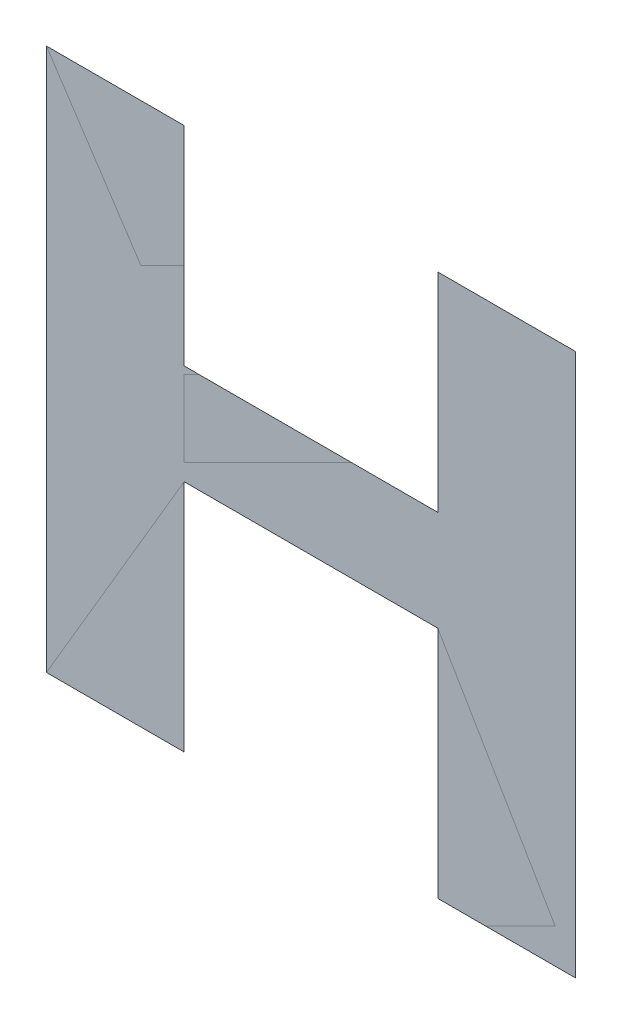
ISO-10303-21;
HEADER;
FILE_DESCRIPTION(('STEP AP214'),'2;1');
FILE_NAME('part.step','',(''),(''),'','','');
FILE_SCHEMA(('AUTOMOTIVE_DESIGN { 1 0 10303 214 1 1 1 1 }'));
ENDSEC;
DATA;
#1=APPLICATION_CONTEXT('core data for automotive mechanical design processes');
#2=APPLICATION_PROTOCOL_DEFINITION('international standard','automotive_design',2000,#1);
#3=PRODUCT_CONTEXT('',#1,'mechanical');
#4=PRODUCT('Part','Part','',(#3));
#5=PRODUCT_RELATED_PRODUCT_CATEGORY('part','',(#4));
#6=PRODUCT_DEFINITION_FORMATION('','',#4);
#7=PRODUCT_DEFINITION_CONTEXT('part definition',#1,'design');
#8=PRODUCT_DEFINITION('design','',#6,#7);
#9=PRODUCT_DEFINITION_SHAPE('','',#8);
#10=(LENGTH_UNIT() NAMED_UNIT(*) SI_UNIT(.MILLI.,.METRE.));
#11=(NAMED_UNIT(*) PLANE_ANGLE_UNIT() SI_UNIT($,.RADIAN.));
#12=(NAMED_UNIT(*) SI_UNIT($,.STERADIAN.) SOLID_ANGLE_UNIT());
#13=UNCERTAINTY_MEASURE_WITH_UNIT(LENGTH_MEASURE(1.E-05),#10,'distance_accuracy_value','');
#14=(GEOMETRIC_REPRESENTATION_CONTEXT(3) GLOBAL_UNCERTAINTY_ASSIGNED_CONTEXT((#13)) GLOBAL_UNIT_ASSIGNED_CONTEXT((#10,
#11,#12)) REPRESENTATION_CONTEXT('',''));
#15=CARTESIAN_POINT('',(0.,0.,0.));
#16=DIRECTION('',(0.,0.,1.));
#17=DIRECTION('',(1.,0.,0.));
#18=AXIS2_PLACEMENT_3D('',#15,#16,#17);
#19=CARTESIAN_POINT('',(-0.03889784466568,0.899692190159,0.00015));
#20=DIRECTION('',(0.,0.,1.));
#21=DIRECTION('',(1.,0.,0.));
#22=AXIS2_PLACEMENT_3D('',#19,#20,#21);
#23=PLANE('',#22);
#24=CARTESIAN_POINT('',(-0.03275983306565,0.915878498909,0.00015));
#25=DIRECTION('',(-1.,0.,0.));
#26=VECTOR('',#25,1.);
#27=LINE('',#24,#26);
#28=CARTESIAN_POINT('',(-0.03275983306565,0.915878498909,7.5E-05));
#29=VERTEX_POINT('',#28);
#30=CARTESIAN_POINT('',(-0.04503788826568,0.915878498909,7.5E-05));
#31=VERTEX_POINT('',#30);
#32=EDGE_CURVE('E182',#29,#31,#27,.T.);
#33=ORIENTED_EDGE('',*,*,#32,.T.);
#34=CARTESIAN_POINT('',(-0.04503788826568,0.915878498909,0.00015));
#35=DIRECTION('',(0.,1.,0.));
#36=VECTOR('',#35,1.);
#37=LINE('',#34,#36);
#38=CARTESIAN_POINT('',(-0.04503788826568,0.92595557828,7.5E-05));
#39=VERTEX_POINT('',#38);
#40=EDGE_CURVE('E28',#31,#39,#37,.T.);
#41=ORIENTED_EDGE('',*,*,#40,.T.);
#42=CARTESIAN_POINT('',(-0.04503788826568,0.92595557828,0.00015));
#43=DIRECTION('',(-1.,0.,0.));
#44=VECTOR('',#43,1.);
#45=LINE('',#42,#44);
#46=CARTESIAN_POINT('',(-0.051706503749,0.92595557828,7.5E-05));
#47=VERTEX_POINT('',#46);
#48=EDGE_CURVE('E11',#39,#47,#45,.T.);
#49=ORIENTED_EDGE('',*,*,#48,.T.);
#50=CARTESIAN_POINT('',(-0.051706503749,0.92595557828,0.00015));
#51=DIRECTION('',(0.,-1.,0.));
#52=VECTOR('',#51,1.);
#53=LINE('',#50,#52);
#54=CARTESIAN_POINT('',(-0.051706503749,0.899692190159,7.5E-05));
#55=VERTEX_POINT('',#54);
#56=EDGE_CURVE('E68',#47,#55,#53,.T.);
#57=ORIENTED_EDGE('',*,*,#56,.T.);
#58=CARTESIAN_POINT('',(-0.051706503749,0.899692190159,0.00015));
#59=DIRECTION('',(1.,0.,0.));
#60=VECTOR('',#59,1.);
#61=LINE('',#58,#60);
#62=CARTESIAN_POINT('',(-0.04503788826568,0.899692190159,7.5E-05));
#63=VERTEX_POINT('',#62);
#64=EDGE_CURVE('E65',#55,#63,#61,.T.);
#65=ORIENTED_EDGE('',*,*,#64,.T.);
#66=CARTESIAN_POINT('',(-0.04503788826568,0.899692190159,0.00015));
#67=DIRECTION('',(0.,1.,0.));
#68=VECTOR('',#67,1.);
#69=LINE('',#66,#68);
#70=CARTESIAN_POINT('',(-0.04503788826568,0.911022809272,7.5E-05));
#71=VERTEX_POINT('',#70);
#72=EDGE_CURVE('E170',#63,#71,#69,.T.);
#73=ORIENTED_EDGE('',*,*,#72,.T.);
#74=CARTESIAN_POINT('',(-0.04503788826568,0.911022809272,0.00015));
#75=DIRECTION('',(1.,0.,0.));
#76=VECTOR('',#75,1.);
#77=LINE('',#74,#76);
#78=CARTESIAN_POINT('',(-0.03275983306565,0.911022809272,7.5E-05));
#79=VERTEX_POINT('',#78);
#80=EDGE_CURVE('E171',#71,#79,#77,.T.);
#81=ORIENTED_EDGE('',*,*,#80,.T.);
#82=CARTESIAN_POINT('',(-0.03275983306565,0.911022809272,0.00015));
#83=DIRECTION('',(0.,-1.,0.));
#84=VECTOR('',#83,1.);
#85=LINE('',#82,#84);
#86=CARTESIAN_POINT('',(-0.03275983306565,0.899692190159,7.5E-05));
#87=VERTEX_POINT('',#86);
#88=EDGE_CURVE('E172',#79,#87,#85,.T.);
#89=ORIENTED_EDGE('',*,*,#88,.T.);
#90=CARTESIAN_POINT('',(-0.03275983306565,0.899692190159,0.00015));
#91=DIRECTION('',(1.,0.,0.));
#92=VECTOR('',#91,1.);
#93=LINE('',#90,#92);
#94=CARTESIAN_POINT('',(-0.02608918558235,0.899692190159,7.5E-05));
#95=VERTEX_POINT('',#94);
#96=EDGE_CURVE('E174',#87,#95,#93,.T.);
#97=ORIENTED_EDGE('',*,*,#96,.T.);
#98=CARTESIAN_POINT('',(-0.02608918558235,0.899692190159,0.00015));
#99=DIRECTION('',(0.,1.,0.));
#100=VECTOR('',#99,1.);
#101=LINE('',#98,#100);
#102=CARTESIAN_POINT('',(-0.02608918558235,0.92595557828,7.5E-05));
#103=VERTEX_POINT('',#102);
#104=EDGE_CURVE('E176',#95,#103,#101,.T.);
#105=ORIENTED_EDGE('',*,*,#104,.T.);
#106=CARTESIAN_POINT('',(-0.02608918558235,0.92595557828,0.00015));
#107=DIRECTION('',(-1.,0.,0.));
#108=VECTOR('',#107,1.);
#109=LINE('',#106,#108);
#110=CARTESIAN_POINT('',(-0.03275983306565,0.92595557828,7.5E-05));
#111=VERTEX_POINT('',#110);
#112=EDGE_CURVE('E178',#103,#111,#109,.T.);
#113=ORIENTED_EDGE('',*,*,#112,.T.);
#114=CARTESIAN_POINT('',(-0.03275983306565,0.92595557828,0.00015));
#115=DIRECTION('',(0.,-1.,0.));
#116=VECTOR('',#115,1.);
#117=LINE('',#114,#116);
#118=EDGE_CURVE('E180',#111,#29,#117,.T.);
#119=ORIENTED_EDGE('',*,*,#118,.T.);
#120=EDGE_LOOP('',(#33,#41,#49,#57,#65,#73,#81,#89,#97,#105,#113,#119));
#121=FACE_BOUND('',#120,.T.);
#122=ADVANCED_FACE('F17',(#121),#23,.T.);
#123=CARTESIAN_POINT('',(-0.03889784466568,0.899692190159,0.));
#124=DIRECTION('',(0.,0.,1.));
#125=DIRECTION('',(1.,0.,0.));
#126=AXIS2_PLACEMENT_3D('',#123,#124,#125);
#127=PLANE('',#126);
#128=ORIENTED_EDGE('',*,*,#40,.F.);
#129=ORIENTED_EDGE('',*,*,#32,.F.);
#130=ORIENTED_EDGE('',*,*,#118,.F.);
#131=ORIENTED_EDGE('',*,*,#112,.F.);
#132=ORIENTED_EDGE('',*,*,#104,.F.);
#133=ORIENTED_EDGE('',*,*,#96,.F.);
#134=ORIENTED_EDGE('',*,*,#88,.F.);
#135=ORIENTED_EDGE('',*,*,#80,.F.);
#136=ORIENTED_EDGE('',*,*,#72,.F.);
#137=ORIENTED_EDGE('',*,*,#64,.F.);
#138=ORIENTED_EDGE('',*,*,#56,.F.);
#139=ORIENTED_EDGE('',*,*,#48,.F.);
#140=EDGE_LOOP('',(#128,#129,#130,#131,#132,#133,#134,#135,#136,#137,#138,#139));
#141=FACE_BOUND('',#140,.T.);
#142=ADVANCED_FACE('F70',(#141),#127,.F.);
#143=CLOSED_SHELL('',(#122,#142));
#144=MANIFOLD_SOLID_BREP('B1',#143);
#145=ADVANCED_BREP_SHAPE_REPRESENTATION('',(#18,#144),#14);
#146=SHAPE_DEFINITION_REPRESENTATION(#9,#145);
ENDSEC;
END-ISO-10303-21;
